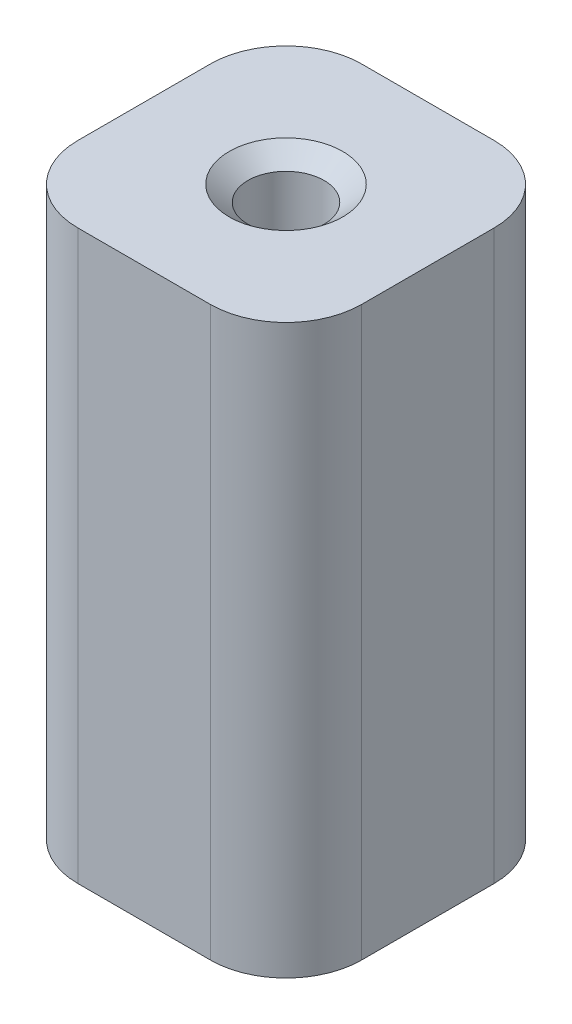
ISO-10303-21;
HEADER;
FILE_DESCRIPTION(('STEP AP214'),'2;1');
FILE_NAME('part.step','',(''),(''),'','','');
FILE_SCHEMA(('AUTOMOTIVE_DESIGN { 1 0 10303 214 1 1 1 1 }'));
ENDSEC;
DATA;
#1=APPLICATION_CONTEXT('core data for automotive mechanical design processes');
#2=APPLICATION_PROTOCOL_DEFINITION('international standard','automotive_design',2000,#1);
#3=PRODUCT_CONTEXT('',#1,'mechanical');
#4=PRODUCT('Part','Part','',(#3));
#5=PRODUCT_RELATED_PRODUCT_CATEGORY('part','',(#4));
#6=PRODUCT_DEFINITION_FORMATION('','',#4);
#7=PRODUCT_DEFINITION_CONTEXT('part definition',#1,'design');
#8=PRODUCT_DEFINITION('design','',#6,#7);
#9=PRODUCT_DEFINITION_SHAPE('','',#8);
#10=(LENGTH_UNIT() NAMED_UNIT(*) SI_UNIT(.MILLI.,.METRE.));
#11=(NAMED_UNIT(*) PLANE_ANGLE_UNIT() SI_UNIT($,.RADIAN.));
#12=(NAMED_UNIT(*) SI_UNIT($,.STERADIAN.) SOLID_ANGLE_UNIT());
#13=UNCERTAINTY_MEASURE_WITH_UNIT(LENGTH_MEASURE(1.E-05),#10,'distance_accuracy_value','');
#14=(GEOMETRIC_REPRESENTATION_CONTEXT(3) GLOBAL_UNCERTAINTY_ASSIGNED_CONTEXT((#13)) GLOBAL_UNIT_ASSIGNED_CONTEXT((#10,
#11,#12)) REPRESENTATION_CONTEXT('',''));
#15=CARTESIAN_POINT('',(0.,0.,0.));
#16=DIRECTION('',(0.,0.,1.));
#17=DIRECTION('',(1.,0.,0.));
#18=AXIS2_PLACEMENT_3D('',#15,#16,#17);
#19=CARTESIAN_POINT('',(9.525,38.1,9.525));
#20=DIRECTION('',(-1.,0.,0.));
#21=DIRECTION('',(0.,0.,1.));
#22=AXIS2_PLACEMENT_3D('',#19,#20,#21);
#23=PLANE('',#22);
#24=DIRECTION('',(0.,0.,-1.));
#25=VECTOR('',#24,1.);
#26=CARTESIAN_POINT('',(9.525,0.,9.525));
#27=LINE('',#26,#25);
#28=CARTESIAN_POINT('',(9.525,0.,4.445));
#29=VERTEX_POINT('',#28);
#30=CARTESIAN_POINT('',(9.525,0.,-4.44499999999999));
#31=VERTEX_POINT('',#30);
#32=EDGE_CURVE('E114',#29,#31,#27,.T.);
#33=ORIENTED_EDGE('',*,*,#32,.T.);
#34=DIRECTION('',(0.,-1.,0.));
#35=VECTOR('',#34,1.);
#36=CARTESIAN_POINT('',(9.525,38.1,-4.445));
#37=LINE('',#36,#35);
#38=CARTESIAN_POINT('',(9.525,38.1,-4.44499999999999));
#39=VERTEX_POINT('',#38);
#40=EDGE_CURVE('E11',#31,#39,#37,.F.);
#41=ORIENTED_EDGE('',*,*,#40,.T.);
#42=DIRECTION('',(0.,0.,-1.));
#43=VECTOR('',#42,1.);
#44=CARTESIAN_POINT('',(9.525,38.1,9.525));
#45=LINE('',#44,#43);
#46=CARTESIAN_POINT('',(9.525,38.1,4.445));
#47=VERTEX_POINT('',#46);
#48=EDGE_CURVE('E125',#47,#39,#45,.T.);
#49=ORIENTED_EDGE('',*,*,#48,.F.);
#50=DIRECTION('',(0.,-1.,0.));
#51=VECTOR('',#50,1.);
#52=CARTESIAN_POINT('',(9.525,38.1,4.445));
#53=LINE('',#52,#51);
#54=EDGE_CURVE('E45',#47,#29,#53,.T.);
#55=ORIENTED_EDGE('',*,*,#54,.T.);
#56=EDGE_LOOP('',(#33,#41,#49,#55));
#57=FACE_BOUND('',#56,.T.);
#58=ADVANCED_FACE('F37',(#57),#23,.F.);
#59=CARTESIAN_POINT('',(-9.525,38.1,-9.525));
#60=DIRECTION('',(0.,0.,1.));
#61=DIRECTION('',(1.,0.,0.));
#62=AXIS2_PLACEMENT_3D('',#59,#60,#61);
#63=PLANE('',#62);
#64=DIRECTION('',(-1.,0.,0.));
#65=VECTOR('',#64,1.);
#66=CARTESIAN_POINT('',(-9.525,0.,-9.525));
#67=LINE('',#66,#65);
#68=CARTESIAN_POINT('',(4.44499999999999,0.,-9.525));
#69=VERTEX_POINT('',#68);
#70=CARTESIAN_POINT('',(-4.445,0.,-9.525));
#71=VERTEX_POINT('',#70);
#72=EDGE_CURVE('E118',#69,#71,#67,.T.);
#73=ORIENTED_EDGE('',*,*,#72,.T.);
#74=DIRECTION('',(0.,-1.,0.));
#75=VECTOR('',#74,1.);
#76=CARTESIAN_POINT('',(-4.445,38.1,-9.525));
#77=LINE('',#76,#75);
#78=CARTESIAN_POINT('',(-4.445,38.1,-9.525));
#79=VERTEX_POINT('',#78);
#80=EDGE_CURVE('E52',#71,#79,#77,.F.);
#81=ORIENTED_EDGE('',*,*,#80,.T.);
#82=DIRECTION('',(-1.,0.,0.));
#83=VECTOR('',#82,1.);
#84=CARTESIAN_POINT('',(-9.525,38.1,-9.525));
#85=LINE('',#84,#83);
#86=CARTESIAN_POINT('',(4.44499999999999,38.1,-9.525));
#87=VERTEX_POINT('',#86);
#88=EDGE_CURVE('E127',#87,#79,#85,.T.);
#89=ORIENTED_EDGE('',*,*,#88,.F.);
#90=DIRECTION('',(0.,-1.,0.));
#91=VECTOR('',#90,1.);
#92=CARTESIAN_POINT('',(4.445,38.1,-9.525));
#93=LINE('',#92,#91);
#94=EDGE_CURVE('E167',#87,#69,#93,.T.);
#95=ORIENTED_EDGE('',*,*,#94,.T.);
#96=EDGE_LOOP('',(#73,#81,#89,#95));
#97=FACE_BOUND('',#96,.T.);
#98=ADVANCED_FACE('F184',(#97),#63,.F.);
#99=CARTESIAN_POINT('',(-9.525,38.1,9.525));
#100=DIRECTION('',(1.,0.,0.));
#101=DIRECTION('',(0.,0.,-1.));
#102=AXIS2_PLACEMENT_3D('',#99,#100,#101);
#103=PLANE('',#102);
#104=DIRECTION('',(0.,0.,1.));
#105=VECTOR('',#104,1.);
#106=CARTESIAN_POINT('',(-9.525,0.,9.525));
#107=LINE('',#106,#105);
#108=CARTESIAN_POINT('',(-9.525,0.,-4.44499999999999));
#109=VERTEX_POINT('',#108);
#110=CARTESIAN_POINT('',(-9.525,0.,4.445));
#111=VERTEX_POINT('',#110);
#112=EDGE_CURVE('E138',#109,#111,#107,.T.);
#113=ORIENTED_EDGE('',*,*,#112,.T.);
#114=DIRECTION('',(0.,-1.,0.));
#115=VECTOR('',#114,1.);
#116=CARTESIAN_POINT('',(-9.525,38.1,4.445));
#117=LINE('',#116,#115);
#118=CARTESIAN_POINT('',(-9.525,38.1,4.445));
#119=VERTEX_POINT('',#118);
#120=EDGE_CURVE('E158',#111,#119,#117,.F.);
#121=ORIENTED_EDGE('',*,*,#120,.T.);
#122=DIRECTION('',(0.,0.,1.));
#123=VECTOR('',#122,1.);
#124=CARTESIAN_POINT('',(-9.525,38.1,9.525));
#125=LINE('',#124,#123);
#126=CARTESIAN_POINT('',(-9.525,38.1,-4.44499999999999));
#127=VERTEX_POINT('',#126);
#128=EDGE_CURVE('E130',#127,#119,#125,.T.);
#129=ORIENTED_EDGE('',*,*,#128,.F.);
#130=DIRECTION('',(0.,-1.,0.));
#131=VECTOR('',#130,1.);
#132=CARTESIAN_POINT('',(-9.525,38.1,-4.445));
#133=LINE('',#132,#131);
#134=EDGE_CURVE('E155',#127,#109,#133,.T.);
#135=ORIENTED_EDGE('',*,*,#134,.T.);
#136=EDGE_LOOP('',(#113,#121,#129,#135));
#137=FACE_BOUND('',#136,.T.);
#138=ADVANCED_FACE('F193',(#137),#103,.F.);
#139=CARTESIAN_POINT('',(-9.525,38.1,9.525));
#140=DIRECTION('',(0.,0.,-1.));
#141=DIRECTION('',(-1.,0.,0.));
#142=AXIS2_PLACEMENT_3D('',#139,#140,#141);
#143=PLANE('',#142);
#144=DIRECTION('',(1.,0.,0.));
#145=VECTOR('',#144,1.);
#146=CARTESIAN_POINT('',(-9.525,38.1,9.525));
#147=LINE('',#146,#145);
#148=CARTESIAN_POINT('',(-4.445,38.1,9.525));
#149=VERTEX_POINT('',#148);
#150=CARTESIAN_POINT('',(4.44499999999999,38.1,9.525));
#151=VERTEX_POINT('',#150);
#152=EDGE_CURVE('E133',#149,#151,#147,.T.);
#153=ORIENTED_EDGE('',*,*,#152,.F.);
#154=DIRECTION('',(0.,-1.,0.));
#155=VECTOR('',#154,1.);
#156=CARTESIAN_POINT('',(-4.445,38.1,9.525));
#157=LINE('',#156,#155);
#158=CARTESIAN_POINT('',(-4.445,0.,9.525));
#159=VERTEX_POINT('',#158);
#160=EDGE_CURVE('E144',#149,#159,#157,.T.);
#161=ORIENTED_EDGE('',*,*,#160,.T.);
#162=DIRECTION('',(1.,0.,0.));
#163=VECTOR('',#162,1.);
#164=CARTESIAN_POINT('',(-9.525,0.,9.525));
#165=LINE('',#164,#163);
#166=CARTESIAN_POINT('',(4.44499999999999,0.,9.525));
#167=VERTEX_POINT('',#166);
#168=EDGE_CURVE('E128',#159,#167,#165,.T.);
#169=ORIENTED_EDGE('',*,*,#168,.T.);
#170=DIRECTION('',(0.,-1.,0.));
#171=VECTOR('',#170,1.);
#172=CARTESIAN_POINT('',(4.445,38.1,9.525));
#173=LINE('',#172,#171);
#174=EDGE_CURVE('E135',#167,#151,#173,.F.);
#175=ORIENTED_EDGE('',*,*,#174,.T.);
#176=EDGE_LOOP('',(#153,#161,#169,#175));
#177=FACE_BOUND('',#176,.T.);
#178=ADVANCED_FACE('F201',(#177),#143,.F.);
#179=CARTESIAN_POINT('',(0.,38.1,0.));
#180=DIRECTION('',(0.,-1.,0.));
#181=DIRECTION('',(0.,0.,-1.));
#182=AXIS2_PLACEMENT_3D('',#179,#180,#181);
#183=PLANE('',#182);
#184=CARTESIAN_POINT('',(0.,38.1,0.));
#185=DIRECTION('',(0.,1.,0.));
#186=DIRECTION('',(0.,0.,1.));
#187=AXIS2_PLACEMENT_3D('',#184,#185,#186);
#188=CIRCLE('',#187,3.81);
#189=CARTESIAN_POINT('',(0.,38.1,3.81));
#190=VERTEX_POINT('',#189);
#191=EDGE_CURVE('E121',#190,#190,#188,.T.);
#192=ORIENTED_EDGE('',*,*,#191,.F.);
#193=EDGE_LOOP('',(#192));
#194=FACE_BOUND('',#193,.T.);
#195=ORIENTED_EDGE('',*,*,#128,.T.);
#196=CARTESIAN_POINT('',(-4.445,38.1,4.445));
#197=DIRECTION('',(0.,-1.,0.));
#198=DIRECTION('',(0.,0.,-1.));
#199=AXIS2_PLACEMENT_3D('',#196,#197,#198);
#200=CIRCLE('',#199,5.08);
#201=EDGE_CURVE('E165',#119,#149,#200,.F.);
#202=ORIENTED_EDGE('',*,*,#201,.T.);
#203=ORIENTED_EDGE('',*,*,#152,.T.);
#204=CARTESIAN_POINT('',(4.445,38.1,4.445));
#205=DIRECTION('',(0.,-1.,0.));
#206=DIRECTION('',(0.,0.,-1.));
#207=AXIS2_PLACEMENT_3D('',#204,#205,#206);
#208=CIRCLE('',#207,5.08);
#209=EDGE_CURVE('E160',#151,#47,#208,.F.);
#210=ORIENTED_EDGE('',*,*,#209,.T.);
#211=ORIENTED_EDGE('',*,*,#48,.T.);
#212=CARTESIAN_POINT('',(4.445,38.1,-4.445));
#213=DIRECTION('',(0.,-1.,0.));
#214=DIRECTION('',(0.,0.,-1.));
#215=AXIS2_PLACEMENT_3D('',#212,#213,#214);
#216=CIRCLE('',#215,5.08);
#217=EDGE_CURVE('E59',#39,#87,#216,.F.);
#218=ORIENTED_EDGE('',*,*,#217,.T.);
#219=ORIENTED_EDGE('',*,*,#88,.T.);
#220=CARTESIAN_POINT('',(-4.445,38.1,-4.445));
#221=DIRECTION('',(0.,-1.,0.));
#222=DIRECTION('',(0.,0.,-1.));
#223=AXIS2_PLACEMENT_3D('',#220,#221,#222);
#224=CIRCLE('',#223,5.08);
#225=EDGE_CURVE('E163',#79,#127,#224,.F.);
#226=ORIENTED_EDGE('',*,*,#225,.T.);
#227=EDGE_LOOP('',(#195,#202,#203,#210,#211,#218,#219,#226));
#228=FACE_BOUND('',#227,.T.);
#229=ADVANCED_FACE('F186',(#194,#228),#183,.F.);
#230=CARTESIAN_POINT('',(0.,0.,0.));
#231=DIRECTION('',(0.,-1.,0.));
#232=DIRECTION('',(0.,0.,-1.));
#233=AXIS2_PLACEMENT_3D('',#230,#231,#232);
#234=PLANE('',#233);
#235=ORIENTED_EDGE('',*,*,#168,.F.);
#236=CARTESIAN_POINT('',(-4.445,0.,4.445));
#237=DIRECTION('',(0.,-1.,0.));
#238=DIRECTION('',(0.,0.,-1.));
#239=AXIS2_PLACEMENT_3D('',#236,#237,#238);
#240=CIRCLE('',#239,5.08);
#241=EDGE_CURVE('E153',#159,#111,#240,.T.);
#242=ORIENTED_EDGE('',*,*,#241,.T.);
#243=ORIENTED_EDGE('',*,*,#112,.F.);
#244=CARTESIAN_POINT('',(-4.445,0.,-4.445));
#245=DIRECTION('',(0.,-1.,0.));
#246=DIRECTION('',(0.,0.,-1.));
#247=AXIS2_PLACEMENT_3D('',#244,#245,#246);
#248=CIRCLE('',#247,5.08);
#249=EDGE_CURVE('E151',#109,#71,#248,.T.);
#250=ORIENTED_EDGE('',*,*,#249,.T.);
#251=ORIENTED_EDGE('',*,*,#72,.F.);
#252=CARTESIAN_POINT('',(4.445,0.,-4.445));
#253=DIRECTION('',(0.,-1.,0.));
#254=DIRECTION('',(0.,0.,-1.));
#255=AXIS2_PLACEMENT_3D('',#252,#253,#254);
#256=CIRCLE('',#255,5.08);
#257=EDGE_CURVE('E149',#69,#31,#256,.T.);
#258=ORIENTED_EDGE('',*,*,#257,.T.);
#259=ORIENTED_EDGE('',*,*,#32,.F.);
#260=CARTESIAN_POINT('',(4.445,0.,4.445));
#261=DIRECTION('',(0.,-1.,0.));
#262=DIRECTION('',(0.,0.,-1.));
#263=AXIS2_PLACEMENT_3D('',#260,#261,#262);
#264=CIRCLE('',#263,5.08);
#265=EDGE_CURVE('E147',#29,#167,#264,.T.);
#266=ORIENTED_EDGE('',*,*,#265,.T.);
#267=EDGE_LOOP('',(#235,#242,#243,#250,#251,#258,#259,#266));
#268=FACE_BOUND('',#267,.T.);
#269=ADVANCED_FACE('F108',(#268),#234,.T.);
#270=CARTESIAN_POINT('',(0.,12.7,0.));
#271=DIRECTION('',(0.,1.,0.));
#272=DIRECTION('',(0.,0.,1.));
#273=AXIS2_PLACEMENT_3D('',#270,#271,#272);
#274=CONICAL_SURFACE('',#273,2.55269999999999,1.02974425867665);
#275=CARTESIAN_POINT('',(0.,11.1661830978083,0.));
#276=VERTEX_POINT('',#275);
#277=VERTEX_LOOP('',#276);
#278=FACE_BOUND('',#277,.T.);
#279=CARTESIAN_POINT('',(0.,12.7,0.));
#280=DIRECTION('',(0.,1.,0.));
#281=DIRECTION('',(0.,0.,1.));
#282=AXIS2_PLACEMENT_3D('',#279,#280,#281);
#283=CIRCLE('',#282,2.55269999999999);
#284=CARTESIAN_POINT('',(0.,12.7,2.55269999999999));
#285=VERTEX_POINT('',#284);
#286=EDGE_CURVE('E112',#285,#285,#283,.T.);
#287=ORIENTED_EDGE('',*,*,#286,.T.);
#288=EDGE_LOOP('',(#287));
#289=FACE_BOUND('',#288,.T.);
#290=ADVANCED_FACE('F104',(#278,#289),#274,.F.);
#291=CARTESIAN_POINT('',(0.,38.1,0.));
#292=DIRECTION('',(0.,1.,0.));
#293=DIRECTION('',(0.,0.,1.));
#294=AXIS2_PLACEMENT_3D('',#291,#292,#293);
#295=CYLINDRICAL_SURFACE('',#294,2.5527);
#296=ORIENTED_EDGE('',*,*,#286,.F.);
#297=EDGE_LOOP('',(#296));
#298=FACE_BOUND('',#297,.T.);
#299=CARTESIAN_POINT('',(0.,37.0450000337208,0.));
#300=DIRECTION('',(0.,1.,0.));
#301=DIRECTION('',(0.,0.,1.));
#302=AXIS2_PLACEMENT_3D('',#299,#300,#301);
#303=CIRCLE('',#302,2.5527);
#304=CARTESIAN_POINT('',(0.,37.0450000337208,2.5527));
#305=VERTEX_POINT('',#304);
#306=EDGE_CURVE('E115',#305,#305,#303,.T.);
#307=ORIENTED_EDGE('',*,*,#306,.T.);
#308=EDGE_LOOP('',(#307));
#309=FACE_BOUND('',#308,.T.);
#310=ADVANCED_FACE('F107',(#298,#309),#295,.F.);
#311=CARTESIAN_POINT('',(0.,38.1,0.));
#312=DIRECTION('',(0.,1.,0.));
#313=DIRECTION('',(0.,0.,1.));
#314=AXIS2_PLACEMENT_3D('',#311,#312,#313);
#315=CONICAL_SURFACE('',#314,3.81,0.872664625997164);
#316=ORIENTED_EDGE('',*,*,#306,.F.);
#317=EDGE_LOOP('',(#316));
#318=FACE_BOUND('',#317,.T.);
#319=ORIENTED_EDGE('',*,*,#191,.T.);
#320=EDGE_LOOP('',(#319));
#321=FACE_BOUND('',#320,.T.);
#322=ADVANCED_FACE('F217',(#318,#321),#315,.F.);
#323=CARTESIAN_POINT('',(-4.445,38.1,4.445));
#324=DIRECTION('',(0.,-1.,0.));
#325=DIRECTION('',(0.,0.,-1.));
#326=AXIS2_PLACEMENT_3D('',#323,#324,#325);
#327=CYLINDRICAL_SURFACE('',#326,5.08);
#328=ORIENTED_EDGE('',*,*,#201,.F.);
#329=ORIENTED_EDGE('',*,*,#120,.F.);
#330=ORIENTED_EDGE('',*,*,#241,.F.);
#331=ORIENTED_EDGE('',*,*,#160,.F.);
#332=EDGE_LOOP('',(#328,#329,#330,#331));
#333=FACE_BOUND('',#332,.T.);
#334=ADVANCED_FACE('F198',(#333),#327,.T.);
#335=CARTESIAN_POINT('',(-4.445,38.1,-4.445));
#336=DIRECTION('',(0.,-1.,0.));
#337=DIRECTION('',(0.,0.,-1.));
#338=AXIS2_PLACEMENT_3D('',#335,#336,#337);
#339=CYLINDRICAL_SURFACE('',#338,5.08);
#340=ORIENTED_EDGE('',*,*,#225,.F.);
#341=ORIENTED_EDGE('',*,*,#80,.F.);
#342=ORIENTED_EDGE('',*,*,#249,.F.);
#343=ORIENTED_EDGE('',*,*,#134,.F.);
#344=EDGE_LOOP('',(#340,#341,#342,#343));
#345=FACE_BOUND('',#344,.T.);
#346=ADVANCED_FACE('F190',(#345),#339,.T.);
#347=CARTESIAN_POINT('',(4.445,38.1,-4.445));
#348=DIRECTION('',(0.,-1.,0.));
#349=DIRECTION('',(0.,0.,-1.));
#350=AXIS2_PLACEMENT_3D('',#347,#348,#349);
#351=CYLINDRICAL_SURFACE('',#350,5.08);
#352=ORIENTED_EDGE('',*,*,#217,.F.);
#353=ORIENTED_EDGE('',*,*,#40,.F.);
#354=ORIENTED_EDGE('',*,*,#257,.F.);
#355=ORIENTED_EDGE('',*,*,#94,.F.);
#356=EDGE_LOOP('',(#352,#353,#354,#355));
#357=FACE_BOUND('',#356,.T.);
#358=ADVANCED_FACE('F183',(#357),#351,.T.);
#359=CARTESIAN_POINT('',(4.445,38.1,4.445));
#360=DIRECTION('',(0.,-1.,0.));
#361=DIRECTION('',(0.,0.,-1.));
#362=AXIS2_PLACEMENT_3D('',#359,#360,#361);
#363=CYLINDRICAL_SURFACE('',#362,5.08);
#364=ORIENTED_EDGE('',*,*,#209,.F.);
#365=ORIENTED_EDGE('',*,*,#174,.F.);
#366=ORIENTED_EDGE('',*,*,#265,.F.);
#367=ORIENTED_EDGE('',*,*,#54,.F.);
#368=EDGE_LOOP('',(#364,#365,#366,#367));
#369=FACE_BOUND('',#368,.T.);
#370=ADVANCED_FACE('F39',(#369),#363,.T.);
#371=CLOSED_SHELL('',(#58,#98,#138,#178,#229,#269,#290,#310,#322,#334,#346,#358,#370));
#372=MANIFOLD_SOLID_BREP('B2',#371);
#373=ADVANCED_BREP_SHAPE_REPRESENTATION('',(#18,#372),#14);
#374=SHAPE_DEFINITION_REPRESENTATION(#9,#373);
ENDSEC;
END-ISO-10303-21;
